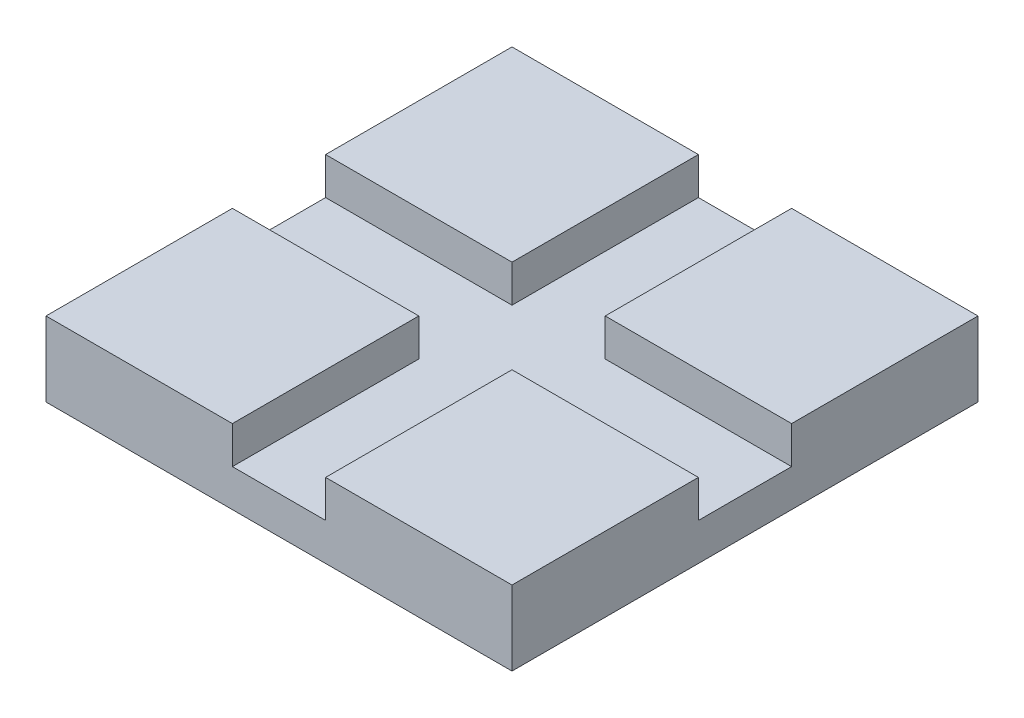
ISO-10303-21;
HEADER;
FILE_DESCRIPTION(('STEP AP214'),'2;1');
FILE_NAME('part.step','',(''),(''),'','','');
FILE_SCHEMA(('AUTOMOTIVE_DESIGN { 1 0 10303 214 1 1 1 1 }'));
ENDSEC;
DATA;
#1=APPLICATION_CONTEXT('core data for automotive mechanical design processes');
#2=APPLICATION_PROTOCOL_DEFINITION('international standard','automotive_design',2000,#1);
#3=PRODUCT_CONTEXT('',#1,'mechanical');
#4=PRODUCT('Part','Part','',(#3));
#5=PRODUCT_RELATED_PRODUCT_CATEGORY('part','',(#4));
#6=PRODUCT_DEFINITION_FORMATION('','',#4);
#7=PRODUCT_DEFINITION_CONTEXT('part definition',#1,'design');
#8=PRODUCT_DEFINITION('design','',#6,#7);
#9=PRODUCT_DEFINITION_SHAPE('','',#8);
#10=(LENGTH_UNIT() NAMED_UNIT(*) SI_UNIT(.MILLI.,.METRE.));
#11=(NAMED_UNIT(*) PLANE_ANGLE_UNIT() SI_UNIT($,.RADIAN.));
#12=(NAMED_UNIT(*) SI_UNIT($,.STERADIAN.) SOLID_ANGLE_UNIT());
#13=UNCERTAINTY_MEASURE_WITH_UNIT(LENGTH_MEASURE(1.E-05),#10,'distance_accuracy_value','');
#14=(GEOMETRIC_REPRESENTATION_CONTEXT(3) GLOBAL_UNCERTAINTY_ASSIGNED_CONTEXT((#13)) GLOBAL_UNIT_ASSIGNED_CONTEXT((#10,
#11,#12)) REPRESENTATION_CONTEXT('',''));
#15=CARTESIAN_POINT('',(0.,0.,0.));
#16=DIRECTION('',(0.,0.,1.));
#17=DIRECTION('',(1.,0.,0.));
#18=AXIS2_PLACEMENT_3D('',#15,#16,#17);
#19=CARTESIAN_POINT('',(0.,2.,0.));
#20=DIRECTION('',(0.,1.,0.));
#21=DIRECTION('',(0.,0.,1.));
#22=AXIS2_PLACEMENT_3D('',#19,#20,#21);
#23=PLANE('',#22);
#24=DIRECTION('',(1.,0.,0.));
#25=VECTOR('',#24,1.);
#26=CARTESIAN_POINT('',(12.5,2.,-2.5));
#27=LINE('',#26,#25);
#28=CARTESIAN_POINT('',(2.5,2.,-2.5));
#29=VERTEX_POINT('',#28);
#30=CARTESIAN_POINT('',(12.5,2.,-2.5));
#31=VERTEX_POINT('',#30);
#32=EDGE_CURVE('E50',#29,#31,#27,.T.);
#33=ORIENTED_EDGE('',*,*,#32,.F.);
#34=DIRECTION('',(0.,0.,1.));
#35=VECTOR('',#34,1.);
#36=CARTESIAN_POINT('',(2.5,2.,-12.5));
#37=LINE('',#36,#35);
#38=CARTESIAN_POINT('',(2.5,2.,-12.5));
#39=VERTEX_POINT('',#38);
#40=EDGE_CURVE('E169',#39,#29,#37,.T.);
#41=ORIENTED_EDGE('',*,*,#40,.F.);
#42=DIRECTION('',(-1.,0.,0.));
#43=VECTOR('',#42,1.);
#44=CARTESIAN_POINT('',(-12.5,2.,-12.5));
#45=LINE('',#44,#43);
#46=CARTESIAN_POINT('',(-2.5,2.,-12.5));
#47=VERTEX_POINT('',#46);
#48=EDGE_CURVE('E254',#39,#47,#45,.T.);
#49=ORIENTED_EDGE('',*,*,#48,.T.);
#50=DIRECTION('',(0.,0.,-1.));
#51=VECTOR('',#50,1.);
#52=CARTESIAN_POINT('',(-2.50000000000001,2.,-12.5));
#53=LINE('',#52,#51);
#54=CARTESIAN_POINT('',(-2.5,2.,-2.5));
#55=VERTEX_POINT('',#54);
#56=EDGE_CURVE('E186',#55,#47,#53,.T.);
#57=ORIENTED_EDGE('',*,*,#56,.F.);
#58=DIRECTION('',(1.,0.,0.));
#59=VECTOR('',#58,1.);
#60=CARTESIAN_POINT('',(-12.5,2.,-2.5));
#61=LINE('',#60,#59);
#62=CARTESIAN_POINT('',(-12.5,2.,-2.5));
#63=VERTEX_POINT('',#62);
#64=EDGE_CURVE('E181',#63,#55,#61,.T.);
#65=ORIENTED_EDGE('',*,*,#64,.F.);
#66=DIRECTION('',(0.,0.,1.));
#67=VECTOR('',#66,1.);
#68=CARTESIAN_POINT('',(-12.5,2.,-12.5));
#69=LINE('',#68,#67);
#70=CARTESIAN_POINT('',(-12.5,2.,2.5));
#71=VERTEX_POINT('',#70);
#72=EDGE_CURVE('E257',#63,#71,#69,.T.);
#73=ORIENTED_EDGE('',*,*,#72,.T.);
#74=DIRECTION('',(-1.,0.,0.));
#75=VECTOR('',#74,1.);
#76=CARTESIAN_POINT('',(-12.5,2.,2.5));
#77=LINE('',#76,#75);
#78=CARTESIAN_POINT('',(-2.5,2.,2.50000000000001));
#79=VERTEX_POINT('',#78);
#80=EDGE_CURVE('E211',#79,#71,#77,.T.);
#81=ORIENTED_EDGE('',*,*,#80,.F.);
#82=DIRECTION('',(0.,0.,-1.));
#83=VECTOR('',#82,1.);
#84=CARTESIAN_POINT('',(-2.5,2.,12.5));
#85=LINE('',#84,#83);
#86=CARTESIAN_POINT('',(-2.5,2.,12.5));
#87=VERTEX_POINT('',#86);
#88=EDGE_CURVE('E206',#87,#79,#85,.T.);
#89=ORIENTED_EDGE('',*,*,#88,.F.);
#90=DIRECTION('',(1.,0.,0.));
#91=VECTOR('',#90,1.);
#92=CARTESIAN_POINT('',(-12.5,2.,12.5));
#93=LINE('',#92,#91);
#94=CARTESIAN_POINT('',(2.5,2.,12.5));
#95=VERTEX_POINT('',#94);
#96=EDGE_CURVE('E259',#87,#95,#93,.T.);
#97=ORIENTED_EDGE('',*,*,#96,.T.);
#98=DIRECTION('',(0.,0.,1.));
#99=VECTOR('',#98,1.);
#100=CARTESIAN_POINT('',(2.5,2.,12.5));
#101=LINE('',#100,#99);
#102=CARTESIAN_POINT('',(2.5,2.,2.5));
#103=VERTEX_POINT('',#102);
#104=EDGE_CURVE('E233',#103,#95,#101,.T.);
#105=ORIENTED_EDGE('',*,*,#104,.F.);
#106=DIRECTION('',(-1.,0.,0.));
#107=VECTOR('',#106,1.);
#108=CARTESIAN_POINT('',(12.5,2.,2.5));
#109=LINE('',#108,#107);
#110=CARTESIAN_POINT('',(12.5,2.,2.5));
#111=VERTEX_POINT('',#110);
#112=EDGE_CURVE('E228',#111,#103,#109,.T.);
#113=ORIENTED_EDGE('',*,*,#112,.F.);
#114=DIRECTION('',(0.,0.,-1.));
#115=VECTOR('',#114,1.);
#116=CARTESIAN_POINT('',(12.5,2.,-12.5));
#117=LINE('',#116,#115);
#118=EDGE_CURVE('E55',#111,#31,#117,.T.);
#119=ORIENTED_EDGE('',*,*,#118,.T.);
#120=EDGE_LOOP('',(#33,#41,#49,#57,#65,#73,#81,#89,#97,#105,#113,#119));
#121=FACE_BOUND('',#120,.T.);
#122=ADVANCED_FACE('F35',(#121),#23,.T.);
#123=CARTESIAN_POINT('',(12.5,2.,-12.5));
#124=DIRECTION('',(-1.,0.,0.));
#125=DIRECTION('',(0.,0.,1.));
#126=AXIS2_PLACEMENT_3D('',#123,#124,#125);
#127=PLANE('',#126);
#128=DIRECTION('',(0.,0.,-1.));
#129=VECTOR('',#128,1.);
#130=CARTESIAN_POINT('',(12.5,0.,-12.5));
#131=LINE('',#130,#129);
#132=CARTESIAN_POINT('',(12.5,0.,12.5));
#133=VERTEX_POINT('',#132);
#134=CARTESIAN_POINT('',(12.5,0.,-12.5));
#135=VERTEX_POINT('',#134);
#136=EDGE_CURVE('E153',#133,#135,#131,.T.);
#137=ORIENTED_EDGE('',*,*,#136,.T.);
#138=DIRECTION('',(0.,-1.,0.));
#139=VECTOR('',#138,1.);
#140=CARTESIAN_POINT('',(12.5,2.,-12.5));
#141=LINE('',#140,#139);
#142=CARTESIAN_POINT('',(12.5,4.,-12.5));
#143=VERTEX_POINT('',#142);
#144=EDGE_CURVE('E11',#143,#135,#141,.T.);
#145=ORIENTED_EDGE('',*,*,#144,.F.);
#146=DIRECTION('',(0.,0.,-1.));
#147=VECTOR('',#146,1.);
#148=CARTESIAN_POINT('',(12.5,4.,-12.5));
#149=LINE('',#148,#147);
#150=CARTESIAN_POINT('',(12.5,4.,-2.5));
#151=VERTEX_POINT('',#150);
#152=EDGE_CURVE('E150',#151,#143,#149,.T.);
#153=ORIENTED_EDGE('',*,*,#152,.F.);
#154=DIRECTION('',(0.,-1.,0.));
#155=VECTOR('',#154,1.);
#156=CARTESIAN_POINT('',(12.5,4.,-2.5));
#157=LINE('',#156,#155);
#158=EDGE_CURVE('E174',#151,#31,#157,.T.);
#159=ORIENTED_EDGE('',*,*,#158,.T.);
#160=ORIENTED_EDGE('',*,*,#118,.F.);
#161=DIRECTION('',(0.,-1.,0.));
#162=VECTOR('',#161,1.);
#163=CARTESIAN_POINT('',(12.5,4.,2.5));
#164=LINE('',#163,#162);
#165=CARTESIAN_POINT('',(12.5,4.,2.5));
#166=VERTEX_POINT('',#165);
#167=EDGE_CURVE('E250',#166,#111,#164,.T.);
#168=ORIENTED_EDGE('',*,*,#167,.F.);
#169=DIRECTION('',(0.,0.,-1.));
#170=VECTOR('',#169,1.);
#171=CARTESIAN_POINT('',(12.5,4.,12.5));
#172=LINE('',#171,#170);
#173=CARTESIAN_POINT('',(12.5,4.,12.5));
#174=VERTEX_POINT('',#173);
#175=EDGE_CURVE('E229',#174,#166,#172,.T.);
#176=ORIENTED_EDGE('',*,*,#175,.F.);
#177=DIRECTION('',(0.,-1.,0.));
#178=VECTOR('',#177,1.);
#179=CARTESIAN_POINT('',(12.5,2.,12.5));
#180=LINE('',#179,#178);
#181=EDGE_CURVE('E261',#174,#133,#180,.T.);
#182=ORIENTED_EDGE('',*,*,#181,.T.);
#183=EDGE_LOOP('',(#137,#145,#153,#159,#160,#168,#176,#182));
#184=FACE_BOUND('',#183,.T.);
#185=ADVANCED_FACE('F37',(#184),#127,.F.);
#186=CARTESIAN_POINT('',(-12.5,2.,-12.5));
#187=DIRECTION('',(0.,0.,1.));
#188=DIRECTION('',(1.,0.,0.));
#189=AXIS2_PLACEMENT_3D('',#186,#187,#188);
#190=PLANE('',#189);
#191=DIRECTION('',(-1.,0.,0.));
#192=VECTOR('',#191,1.);
#193=CARTESIAN_POINT('',(-12.5,0.,-12.5));
#194=LINE('',#193,#192);
#195=CARTESIAN_POINT('',(-12.5,0.,-12.5));
#196=VERTEX_POINT('',#195);
#197=EDGE_CURVE('E263',#135,#196,#194,.T.);
#198=ORIENTED_EDGE('',*,*,#197,.T.);
#199=DIRECTION('',(0.,-1.,0.));
#200=VECTOR('',#199,1.);
#201=CARTESIAN_POINT('',(-12.5,2.,-12.5));
#202=LINE('',#201,#200);
#203=CARTESIAN_POINT('',(-12.5,4.,-12.5));
#204=VERTEX_POINT('',#203);
#205=EDGE_CURVE('E43',#204,#196,#202,.T.);
#206=ORIENTED_EDGE('',*,*,#205,.F.);
#207=DIRECTION('',(-1.,0.,0.));
#208=VECTOR('',#207,1.);
#209=CARTESIAN_POINT('',(-12.5,4.,-12.5));
#210=LINE('',#209,#208);
#211=CARTESIAN_POINT('',(-2.50000000000001,4.,-12.5));
#212=VERTEX_POINT('',#211);
#213=EDGE_CURVE('E190',#212,#204,#210,.T.);
#214=ORIENTED_EDGE('',*,*,#213,.F.);
#215=DIRECTION('',(0.,-1.,0.));
#216=VECTOR('',#215,1.);
#217=CARTESIAN_POINT('',(-2.50000000000001,4.,-12.5));
#218=LINE('',#217,#216);
#219=EDGE_CURVE('E193',#212,#47,#218,.T.);
#220=ORIENTED_EDGE('',*,*,#219,.T.);
#221=ORIENTED_EDGE('',*,*,#48,.F.);
#222=DIRECTION('',(0.,-1.,0.));
#223=VECTOR('',#222,1.);
#224=CARTESIAN_POINT('',(2.5,4.,-12.5));
#225=LINE('',#224,#223);
#226=CARTESIAN_POINT('',(2.5,4.,-12.5));
#227=VERTEX_POINT('',#226);
#228=EDGE_CURVE('E159',#227,#39,#225,.T.);
#229=ORIENTED_EDGE('',*,*,#228,.F.);
#230=DIRECTION('',(-1.,0.,0.));
#231=VECTOR('',#230,1.);
#232=CARTESIAN_POINT('',(12.5,4.,-12.5));
#233=LINE('',#232,#231);
#234=EDGE_CURVE('E156',#143,#227,#233,.T.);
#235=ORIENTED_EDGE('',*,*,#234,.F.);
#236=ORIENTED_EDGE('',*,*,#144,.T.);
#237=EDGE_LOOP('',(#198,#206,#214,#220,#221,#229,#235,#236));
#238=FACE_BOUND('',#237,.T.);
#239=ADVANCED_FACE('F157',(#238),#190,.F.);
#240=CARTESIAN_POINT('',(-12.5,2.,-12.5));
#241=DIRECTION('',(1.,0.,0.));
#242=DIRECTION('',(0.,0.,-1.));
#243=AXIS2_PLACEMENT_3D('',#240,#241,#242);
#244=PLANE('',#243);
#245=DIRECTION('',(0.,0.,1.));
#246=VECTOR('',#245,1.);
#247=CARTESIAN_POINT('',(-12.5,0.,-12.5));
#248=LINE('',#247,#246);
#249=CARTESIAN_POINT('',(-12.5,0.,12.5));
#250=VERTEX_POINT('',#249);
#251=EDGE_CURVE('E265',#196,#250,#248,.T.);
#252=ORIENTED_EDGE('',*,*,#251,.T.);
#253=DIRECTION('',(0.,-1.,0.));
#254=VECTOR('',#253,1.);
#255=CARTESIAN_POINT('',(-12.5,2.,12.5));
#256=LINE('',#255,#254);
#257=CARTESIAN_POINT('',(-12.5,4.,12.5));
#258=VERTEX_POINT('',#257);
#259=EDGE_CURVE('E269',#258,#250,#256,.T.);
#260=ORIENTED_EDGE('',*,*,#259,.F.);
#261=DIRECTION('',(0.,0.,1.));
#262=VECTOR('',#261,1.);
#263=CARTESIAN_POINT('',(-12.5,4.,12.5));
#264=LINE('',#263,#262);
#265=CARTESIAN_POINT('',(-12.5,4.,2.5));
#266=VERTEX_POINT('',#265);
#267=EDGE_CURVE('E207',#266,#258,#264,.T.);
#268=ORIENTED_EDGE('',*,*,#267,.F.);
#269=DIRECTION('',(0.,-1.,0.));
#270=VECTOR('',#269,1.);
#271=CARTESIAN_POINT('',(-12.5,4.,2.5));
#272=LINE('',#271,#270);
#273=EDGE_CURVE('E217',#266,#71,#272,.T.);
#274=ORIENTED_EDGE('',*,*,#273,.T.);
#275=ORIENTED_EDGE('',*,*,#72,.F.);
#276=DIRECTION('',(0.,-1.,0.));
#277=VECTOR('',#276,1.);
#278=CARTESIAN_POINT('',(-12.5,4.,-2.5));
#279=LINE('',#278,#277);
#280=CARTESIAN_POINT('',(-12.5,4.,-2.5));
#281=VERTEX_POINT('',#280);
#282=EDGE_CURVE('E203',#281,#63,#279,.T.);
#283=ORIENTED_EDGE('',*,*,#282,.F.);
#284=DIRECTION('',(0.,0.,1.));
#285=VECTOR('',#284,1.);
#286=CARTESIAN_POINT('',(-12.5,4.,-12.5));
#287=LINE('',#286,#285);
#288=EDGE_CURVE('E182',#204,#281,#287,.T.);
#289=ORIENTED_EDGE('',*,*,#288,.F.);
#290=ORIENTED_EDGE('',*,*,#205,.T.);
#291=EDGE_LOOP('',(#252,#260,#268,#274,#275,#283,#289,#290));
#292=FACE_BOUND('',#291,.T.);
#293=ADVANCED_FACE('F275',(#292),#244,.F.);
#294=CARTESIAN_POINT('',(-12.5,2.,12.5));
#295=DIRECTION('',(0.,0.,-1.));
#296=DIRECTION('',(-1.,0.,0.));
#297=AXIS2_PLACEMENT_3D('',#294,#295,#296);
#298=PLANE('',#297);
#299=DIRECTION('',(1.,0.,0.));
#300=VECTOR('',#299,1.);
#301=CARTESIAN_POINT('',(-12.5,0.,12.5));
#302=LINE('',#301,#300);
#303=EDGE_CURVE('E255',#250,#133,#302,.T.);
#304=ORIENTED_EDGE('',*,*,#303,.T.);
#305=ORIENTED_EDGE('',*,*,#181,.F.);
#306=DIRECTION('',(1.,0.,0.));
#307=VECTOR('',#306,1.);
#308=CARTESIAN_POINT('',(12.5,4.,12.5));
#309=LINE('',#308,#307);
#310=CARTESIAN_POINT('',(2.5,4.,12.5));
#311=VERTEX_POINT('',#310);
#312=EDGE_CURVE('E237',#311,#174,#309,.T.);
#313=ORIENTED_EDGE('',*,*,#312,.F.);
#314=DIRECTION('',(0.,-1.,0.));
#315=VECTOR('',#314,1.);
#316=CARTESIAN_POINT('',(2.5,4.,12.5));
#317=LINE('',#316,#315);
#318=EDGE_CURVE('E240',#311,#95,#317,.T.);
#319=ORIENTED_EDGE('',*,*,#318,.T.);
#320=ORIENTED_EDGE('',*,*,#96,.F.);
#321=DIRECTION('',(0.,-1.,0.));
#322=VECTOR('',#321,1.);
#323=CARTESIAN_POINT('',(-2.5,4.,12.5));
#324=LINE('',#323,#322);
#325=CARTESIAN_POINT('',(-2.5,4.,12.5));
#326=VERTEX_POINT('',#325);
#327=EDGE_CURVE('E226',#326,#87,#324,.T.);
#328=ORIENTED_EDGE('',*,*,#327,.F.);
#329=DIRECTION('',(1.,0.,0.));
#330=VECTOR('',#329,1.);
#331=CARTESIAN_POINT('',(-12.5,4.,12.5));
#332=LINE('',#331,#330);
#333=EDGE_CURVE('E210',#258,#326,#332,.T.);
#334=ORIENTED_EDGE('',*,*,#333,.F.);
#335=ORIENTED_EDGE('',*,*,#259,.T.);
#336=EDGE_LOOP('',(#304,#305,#313,#319,#320,#328,#334,#335));
#337=FACE_BOUND('',#336,.T.);
#338=ADVANCED_FACE('F282',(#337),#298,.F.);
#339=CARTESIAN_POINT('',(0.,0.,0.));
#340=DIRECTION('',(0.,1.,0.));
#341=DIRECTION('',(0.,0.,1.));
#342=AXIS2_PLACEMENT_3D('',#339,#340,#341);
#343=PLANE('',#342);
#344=ORIENTED_EDGE('',*,*,#136,.F.);
#345=ORIENTED_EDGE('',*,*,#303,.F.);
#346=ORIENTED_EDGE('',*,*,#251,.F.);
#347=ORIENTED_EDGE('',*,*,#197,.F.);
#348=EDGE_LOOP('',(#344,#345,#346,#347));
#349=FACE_BOUND('',#348,.T.);
#350=ADVANCED_FACE('F280',(#349),#343,.F.);
#351=CARTESIAN_POINT('',(12.5,4.,2.5));
#352=DIRECTION('',(0.,0.,1.));
#353=DIRECTION('',(1.,0.,0.));
#354=AXIS2_PLACEMENT_3D('',#351,#352,#353);
#355=PLANE('',#354);
#356=ORIENTED_EDGE('',*,*,#112,.T.);
#357=DIRECTION('',(0.,-1.,0.));
#358=VECTOR('',#357,1.);
#359=CARTESIAN_POINT('',(2.5,4.,2.5));
#360=LINE('',#359,#358);
#361=CARTESIAN_POINT('',(2.5,4.,2.5));
#362=VERTEX_POINT('',#361);
#363=EDGE_CURVE('E247',#362,#103,#360,.T.);
#364=ORIENTED_EDGE('',*,*,#363,.F.);
#365=DIRECTION('',(-1.,0.,0.));
#366=VECTOR('',#365,1.);
#367=CARTESIAN_POINT('',(12.5,4.,2.5));
#368=LINE('',#367,#366);
#369=EDGE_CURVE('E232',#166,#362,#368,.T.);
#370=ORIENTED_EDGE('',*,*,#369,.F.);
#371=ORIENTED_EDGE('',*,*,#167,.T.);
#372=EDGE_LOOP('',(#356,#364,#370,#371));
#373=FACE_BOUND('',#372,.T.);
#374=ADVANCED_FACE('F298',(#373),#355,.F.);
#375=CARTESIAN_POINT('',(2.5,4.,12.5));
#376=DIRECTION('',(1.,0.,0.));
#377=DIRECTION('',(0.,0.,-1.));
#378=AXIS2_PLACEMENT_3D('',#375,#376,#377);
#379=PLANE('',#378);
#380=ORIENTED_EDGE('',*,*,#104,.T.);
#381=ORIENTED_EDGE('',*,*,#318,.F.);
#382=DIRECTION('',(0.,0.,1.));
#383=VECTOR('',#382,1.);
#384=CARTESIAN_POINT('',(2.5,4.,12.5));
#385=LINE('',#384,#383);
#386=EDGE_CURVE('E235',#362,#311,#385,.T.);
#387=ORIENTED_EDGE('',*,*,#386,.F.);
#388=ORIENTED_EDGE('',*,*,#363,.T.);
#389=EDGE_LOOP('',(#380,#381,#387,#388));
#390=FACE_BOUND('',#389,.T.);
#391=ADVANCED_FACE('F295',(#390),#379,.F.);
#392=CARTESIAN_POINT('',(0.,4.,0.));
#393=DIRECTION('',(0.,1.,0.));
#394=DIRECTION('',(0.,0.,1.));
#395=AXIS2_PLACEMENT_3D('',#392,#393,#394);
#396=PLANE('',#395);
#397=ORIENTED_EDGE('',*,*,#175,.T.);
#398=ORIENTED_EDGE('',*,*,#369,.T.);
#399=ORIENTED_EDGE('',*,*,#386,.T.);
#400=ORIENTED_EDGE('',*,*,#312,.T.);
#401=EDGE_LOOP('',(#397,#398,#399,#400));
#402=FACE_BOUND('',#401,.T.);
#403=ADVANCED_FACE('F288',(#402),#396,.T.);
#404=CARTESIAN_POINT('',(-2.5,4.,12.5));
#405=DIRECTION('',(-1.,0.,0.));
#406=DIRECTION('',(0.,0.,1.));
#407=AXIS2_PLACEMENT_3D('',#404,#405,#406);
#408=PLANE('',#407);
#409=ORIENTED_EDGE('',*,*,#88,.T.);
#410=DIRECTION('',(0.,-1.,0.));
#411=VECTOR('',#410,1.);
#412=CARTESIAN_POINT('',(-2.5,4.,2.50000000000001));
#413=LINE('',#412,#411);
#414=CARTESIAN_POINT('',(-2.5,4.,2.50000000000001));
#415=VERTEX_POINT('',#414);
#416=EDGE_CURVE('E224',#415,#79,#413,.T.);
#417=ORIENTED_EDGE('',*,*,#416,.F.);
#418=DIRECTION('',(0.,0.,-1.));
#419=VECTOR('',#418,1.);
#420=CARTESIAN_POINT('',(-2.5,4.,12.5));
#421=LINE('',#420,#419);
#422=EDGE_CURVE('E213',#326,#415,#421,.T.);
#423=ORIENTED_EDGE('',*,*,#422,.F.);
#424=ORIENTED_EDGE('',*,*,#327,.T.);
#425=EDGE_LOOP('',(#409,#417,#423,#424));
#426=FACE_BOUND('',#425,.T.);
#427=ADVANCED_FACE('F388',(#426),#408,.F.);
#428=CARTESIAN_POINT('',(-12.5,4.,2.5));
#429=DIRECTION('',(0.,0.,1.));
#430=DIRECTION('',(1.,0.,0.));
#431=AXIS2_PLACEMENT_3D('',#428,#429,#430);
#432=PLANE('',#431);
#433=ORIENTED_EDGE('',*,*,#80,.T.);
#434=ORIENTED_EDGE('',*,*,#273,.F.);
#435=DIRECTION('',(-1.,0.,0.));
#436=VECTOR('',#435,1.);
#437=CARTESIAN_POINT('',(-12.5,4.,2.5));
#438=LINE('',#437,#436);
#439=EDGE_CURVE('E215',#415,#266,#438,.T.);
#440=ORIENTED_EDGE('',*,*,#439,.F.);
#441=ORIENTED_EDGE('',*,*,#416,.T.);
#442=EDGE_LOOP('',(#433,#434,#440,#441));
#443=FACE_BOUND('',#442,.T.);
#444=ADVANCED_FACE('F396',(#443),#432,.F.);
#445=CARTESIAN_POINT('',(0.,4.,0.));
#446=DIRECTION('',(0.,-1.,0.));
#447=DIRECTION('',(0.,0.,-1.));
#448=AXIS2_PLACEMENT_3D('',#445,#446,#447);
#449=PLANE('',#448);
#450=ORIENTED_EDGE('',*,*,#267,.T.);
#451=ORIENTED_EDGE('',*,*,#333,.T.);
#452=ORIENTED_EDGE('',*,*,#422,.T.);
#453=ORIENTED_EDGE('',*,*,#439,.T.);
#454=EDGE_LOOP('',(#450,#451,#452,#453));
#455=FACE_BOUND('',#454,.T.);
#456=ADVANCED_FACE('F405',(#455),#449,.F.);
#457=CARTESIAN_POINT('',(-12.5,4.,-2.5));
#458=DIRECTION('',(0.,0.,-1.));
#459=DIRECTION('',(-1.,0.,0.));
#460=AXIS2_PLACEMENT_3D('',#457,#458,#459);
#461=PLANE('',#460);
#462=ORIENTED_EDGE('',*,*,#64,.T.);
#463=DIRECTION('',(0.,-1.,0.));
#464=VECTOR('',#463,1.);
#465=CARTESIAN_POINT('',(-2.5,4.,-2.5));
#466=LINE('',#465,#464);
#467=CARTESIAN_POINT('',(-2.5,4.,-2.5));
#468=VERTEX_POINT('',#467);
#469=EDGE_CURVE('E200',#468,#55,#466,.T.);
#470=ORIENTED_EDGE('',*,*,#469,.F.);
#471=DIRECTION('',(1.,0.,0.));
#472=VECTOR('',#471,1.);
#473=CARTESIAN_POINT('',(-12.5,4.,-2.5));
#474=LINE('',#473,#472);
#475=EDGE_CURVE('E185',#281,#468,#474,.T.);
#476=ORIENTED_EDGE('',*,*,#475,.F.);
#477=ORIENTED_EDGE('',*,*,#282,.T.);
#478=EDGE_LOOP('',(#462,#470,#476,#477));
#479=FACE_BOUND('',#478,.T.);
#480=ADVANCED_FACE('F414',(#479),#461,.F.);
#481=CARTESIAN_POINT('',(-2.50000000000001,4.,-12.5));
#482=DIRECTION('',(-1.,0.,0.));
#483=DIRECTION('',(0.,0.,1.));
#484=AXIS2_PLACEMENT_3D('',#481,#482,#483);
#485=PLANE('',#484);
#486=ORIENTED_EDGE('',*,*,#56,.T.);
#487=ORIENTED_EDGE('',*,*,#219,.F.);
#488=DIRECTION('',(0.,0.,-1.));
#489=VECTOR('',#488,1.);
#490=CARTESIAN_POINT('',(-2.50000000000001,4.,-12.5));
#491=LINE('',#490,#489);
#492=EDGE_CURVE('E188',#468,#212,#491,.T.);
#493=ORIENTED_EDGE('',*,*,#492,.F.);
#494=ORIENTED_EDGE('',*,*,#469,.T.);
#495=EDGE_LOOP('',(#486,#487,#493,#494));
#496=FACE_BOUND('',#495,.T.);
#497=ADVANCED_FACE('F423',(#496),#485,.F.);
#498=CARTESIAN_POINT('',(0.,4.,0.));
#499=DIRECTION('',(0.,1.,0.));
#500=DIRECTION('',(0.,0.,1.));
#501=AXIS2_PLACEMENT_3D('',#498,#499,#500);
#502=PLANE('',#501);
#503=ORIENTED_EDGE('',*,*,#288,.T.);
#504=ORIENTED_EDGE('',*,*,#475,.T.);
#505=ORIENTED_EDGE('',*,*,#492,.T.);
#506=ORIENTED_EDGE('',*,*,#213,.T.);
#507=EDGE_LOOP('',(#503,#504,#505,#506));
#508=FACE_BOUND('',#507,.T.);
#509=ADVANCED_FACE('F432',(#508),#502,.T.);
#510=CARTESIAN_POINT('',(2.5,4.,-12.5));
#511=DIRECTION('',(1.,0.,0.));
#512=DIRECTION('',(0.,0.,-1.));
#513=AXIS2_PLACEMENT_3D('',#510,#511,#512);
#514=PLANE('',#513);
#515=ORIENTED_EDGE('',*,*,#40,.T.);
#516=DIRECTION('',(0.,-1.,0.));
#517=VECTOR('',#516,1.);
#518=CARTESIAN_POINT('',(2.5,4.,-2.5));
#519=LINE('',#518,#517);
#520=CARTESIAN_POINT('',(2.5,4.,-2.5));
#521=VERTEX_POINT('',#520);
#522=EDGE_CURVE('E177',#521,#29,#519,.T.);
#523=ORIENTED_EDGE('',*,*,#522,.F.);
#524=DIRECTION('',(0.,0.,1.));
#525=VECTOR('',#524,1.);
#526=CARTESIAN_POINT('',(2.5,4.,-12.5));
#527=LINE('',#526,#525);
#528=EDGE_CURVE('E162',#227,#521,#527,.T.);
#529=ORIENTED_EDGE('',*,*,#528,.F.);
#530=ORIENTED_EDGE('',*,*,#228,.T.);
#531=EDGE_LOOP('',(#515,#523,#529,#530));
#532=FACE_BOUND('',#531,.T.);
#533=ADVANCED_FACE('F441',(#532),#514,.F.);
#534=CARTESIAN_POINT('',(12.5,4.,-2.5));
#535=DIRECTION('',(0.,0.,-1.));
#536=DIRECTION('',(-1.,0.,0.));
#537=AXIS2_PLACEMENT_3D('',#534,#535,#536);
#538=PLANE('',#537);
#539=ORIENTED_EDGE('',*,*,#32,.T.);
#540=ORIENTED_EDGE('',*,*,#158,.F.);
#541=DIRECTION('',(1.,0.,0.));
#542=VECTOR('',#541,1.);
#543=CARTESIAN_POINT('',(12.5,4.,-2.5));
#544=LINE('',#543,#542);
#545=EDGE_CURVE('E166',#521,#151,#544,.T.);
#546=ORIENTED_EDGE('',*,*,#545,.F.);
#547=ORIENTED_EDGE('',*,*,#522,.T.);
#548=EDGE_LOOP('',(#539,#540,#546,#547));
#549=FACE_BOUND('',#548,.T.);
#550=ADVANCED_FACE('F450',(#549),#538,.F.);
#551=CARTESIAN_POINT('',(0.,4.,0.));
#552=DIRECTION('',(0.,-1.,0.));
#553=DIRECTION('',(0.,0.,-1.));
#554=AXIS2_PLACEMENT_3D('',#551,#552,#553);
#555=PLANE('',#554);
#556=ORIENTED_EDGE('',*,*,#152,.T.);
#557=ORIENTED_EDGE('',*,*,#234,.T.);
#558=ORIENTED_EDGE('',*,*,#528,.T.);
#559=ORIENTED_EDGE('',*,*,#545,.T.);
#560=EDGE_LOOP('',(#556,#557,#558,#559));
#561=FACE_BOUND('',#560,.T.);
#562=ADVANCED_FACE('F164',(#561),#555,.F.);
#563=CLOSED_SHELL('',(#122,#185,#239,#293,#338,#350,#374,#391,#403,#427,#444,#456,#480,#497,
#509,#533,#550,#562));
#564=MANIFOLD_SOLID_BREP('B2',#563);
#565=ADVANCED_BREP_SHAPE_REPRESENTATION('',(#18,#564),#14);
#566=SHAPE_DEFINITION_REPRESENTATION(#9,#565);
ENDSEC;
END-ISO-10303-21;
